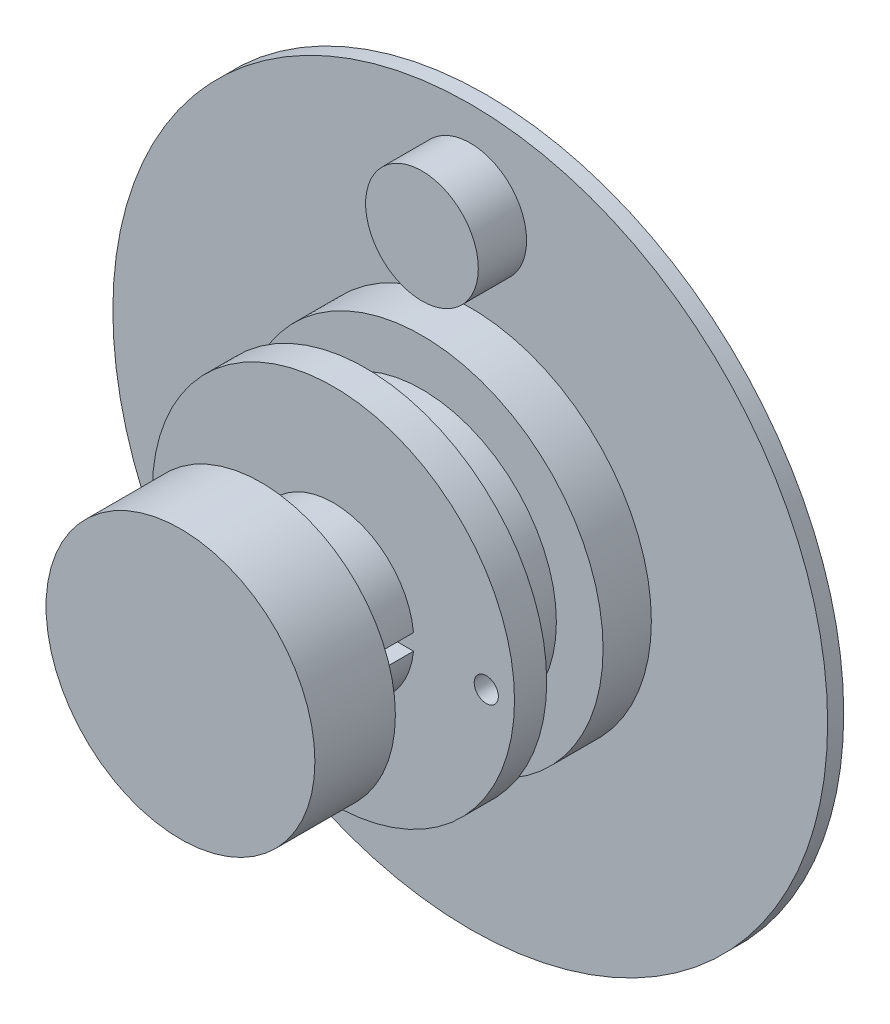
ISO-10303-21;
HEADER;
FILE_DESCRIPTION(('STEP AP214'),'2;1');
FILE_NAME('part.step','',(''),(''),'','','');
FILE_SCHEMA(('AUTOMOTIVE_DESIGN { 1 0 10303 214 1 1 1 1 }'));
ENDSEC;
DATA;
#1=APPLICATION_CONTEXT('core data for automotive mechanical design processes');
#2=APPLICATION_PROTOCOL_DEFINITION('international standard','automotive_design',2000,#1);
#3=PRODUCT_CONTEXT('',#1,'mechanical');
#4=PRODUCT('Part','Part','',(#3));
#5=PRODUCT_RELATED_PRODUCT_CATEGORY('part','',(#4));
#6=PRODUCT_DEFINITION_FORMATION('','',#4);
#7=PRODUCT_DEFINITION_CONTEXT('part definition',#1,'design');
#8=PRODUCT_DEFINITION('design','',#6,#7);
#9=PRODUCT_DEFINITION_SHAPE('','',#8);
#10=(LENGTH_UNIT() NAMED_UNIT(*) SI_UNIT(.MILLI.,.METRE.));
#11=(NAMED_UNIT(*) PLANE_ANGLE_UNIT() SI_UNIT($,.RADIAN.));
#12=(NAMED_UNIT(*) SI_UNIT($,.STERADIAN.) SOLID_ANGLE_UNIT());
#13=UNCERTAINTY_MEASURE_WITH_UNIT(LENGTH_MEASURE(1.E-05),#10,'distance_accuracy_value','');
#14=(GEOMETRIC_REPRESENTATION_CONTEXT(3) GLOBAL_UNCERTAINTY_ASSIGNED_CONTEXT((#13)) GLOBAL_UNIT_ASSIGNED_CONTEXT((#10,
#11,#12)) REPRESENTATION_CONTEXT('',''));
#15=CARTESIAN_POINT('',(0.,0.,0.));
#16=DIRECTION('',(0.,0.,1.));
#17=DIRECTION('',(1.,0.,0.));
#18=AXIS2_PLACEMENT_3D('',#15,#16,#17);
#19=CARTESIAN_POINT('',(0.,0.,9.5));
#20=DIRECTION('',(0.,0.,-1.));
#21=DIRECTION('',(-1.,0.,0.));
#22=AXIS2_PLACEMENT_3D('',#19,#20,#21);
#23=CYLINDRICAL_SURFACE('',#22,11.25);
#24=CARTESIAN_POINT('',(0.,0.,1.));
#25=DIRECTION('',(0.,0.,1.));
#26=DIRECTION('',(1.,0.,0.));
#27=AXIS2_PLACEMENT_3D('',#24,#25,#26);
#28=CIRCLE('',#27,11.25);
#29=CARTESIAN_POINT('',(11.25,0.,1.));
#30=VERTEX_POINT('',#29);
#31=EDGE_CURVE('E110',#30,#30,#28,.T.);
#32=ORIENTED_EDGE('',*,*,#31,.T.);
#33=EDGE_LOOP('',(#32));
#34=FACE_BOUND('',#33,.T.);
#35=CARTESIAN_POINT('',(0.,0.,4.));
#36=DIRECTION('',(0.,0.,1.));
#37=DIRECTION('',(1.,0.,0.));
#38=AXIS2_PLACEMENT_3D('',#35,#36,#37);
#39=CIRCLE('',#38,11.25);
#40=CARTESIAN_POINT('',(11.25,0.,4.));
#41=VERTEX_POINT('',#40);
#42=EDGE_CURVE('E163',#41,#41,#39,.T.);
#43=ORIENTED_EDGE('',*,*,#42,.F.);
#44=EDGE_LOOP('',(#43));
#45=FACE_BOUND('',#44,.T.);
#46=ADVANCED_FACE('F39',(#34,#45),#23,.T.);
#47=CARTESIAN_POINT('',(0.,0.,1.));
#48=DIRECTION('',(0.,0.,-1.));
#49=DIRECTION('',(-1.,0.,0.));
#50=AXIS2_PLACEMENT_3D('',#47,#48,#49);
#51=CYLINDRICAL_SURFACE('',#50,22.2);
#52=CARTESIAN_POINT('',(0.,0.,1.));
#53=DIRECTION('',(0.,0.,1.));
#54=DIRECTION('',(1.,0.,0.));
#55=AXIS2_PLACEMENT_3D('',#52,#53,#54);
#56=CIRCLE('',#55,22.2);
#57=CARTESIAN_POINT('',(22.2,0.,1.));
#58=VERTEX_POINT('',#57);
#59=EDGE_CURVE('E113',#58,#58,#56,.T.);
#60=ORIENTED_EDGE('',*,*,#59,.F.);
#61=EDGE_LOOP('',(#60));
#62=FACE_BOUND('',#61,.T.);
#63=CARTESIAN_POINT('',(0.,0.,0.));
#64=DIRECTION('',(0.,0.,1.));
#65=DIRECTION('',(1.,0.,0.));
#66=AXIS2_PLACEMENT_3D('',#63,#64,#65);
#67=CIRCLE('',#66,22.2);
#68=CARTESIAN_POINT('',(22.2,0.,0.));
#69=VERTEX_POINT('',#68);
#70=EDGE_CURVE('E109',#69,#69,#67,.T.);
#71=ORIENTED_EDGE('',*,*,#70,.T.);
#72=EDGE_LOOP('',(#71));
#73=FACE_BOUND('',#72,.T.);
#74=ADVANCED_FACE('F41',(#62,#73),#51,.T.);
#75=CARTESIAN_POINT('',(0.,0.,1.));
#76=DIRECTION('',(0.,0.,1.));
#77=DIRECTION('',(1.,0.,0.));
#78=AXIS2_PLACEMENT_3D('',#75,#76,#77);
#79=PLANE('',#78);
#80=CARTESIAN_POINT('',(0.,16.6,1.));
#81=DIRECTION('',(0.,0.,1.));
#82=DIRECTION('',(1.,0.,0.));
#83=AXIS2_PLACEMENT_3D('',#80,#81,#82);
#84=CIRCLE('',#83,3.5);
#85=CARTESIAN_POINT('',(3.5,16.6,1.));
#86=VERTEX_POINT('',#85);
#87=EDGE_CURVE('E184',#86,#86,#84,.T.);
#88=ORIENTED_EDGE('',*,*,#87,.F.);
#89=EDGE_LOOP('',(#88));
#90=FACE_BOUND('',#89,.T.);
#91=ORIENTED_EDGE('',*,*,#31,.F.);
#92=EDGE_LOOP('',(#91));
#93=FACE_BOUND('',#92,.T.);
#94=ORIENTED_EDGE('',*,*,#59,.T.);
#95=EDGE_LOOP('',(#94));
#96=FACE_BOUND('',#95,.T.);
#97=ADVANCED_FACE('F122',(#90,#93,#96),#79,.T.);
#98=CARTESIAN_POINT('',(0.,0.,0.));
#99=DIRECTION('',(0.,0.,1.));
#100=DIRECTION('',(1.,0.,0.));
#101=AXIS2_PLACEMENT_3D('',#98,#99,#100);
#102=PLANE('',#101);
#103=CARTESIAN_POINT('',(0.,0.,0.));
#104=DIRECTION('',(0.,0.,-1.));
#105=DIRECTION('',(-1.,0.,0.));
#106=AXIS2_PLACEMENT_3D('',#103,#104,#105);
#107=CIRCLE('',#106,6.);
#108=CARTESIAN_POINT('',(-6.,0.,0.));
#109=VERTEX_POINT('',#108);
#110=EDGE_CURVE('E180',#109,#109,#107,.T.);
#111=ORIENTED_EDGE('',*,*,#110,.F.);
#112=EDGE_LOOP('',(#111));
#113=FACE_BOUND('',#112,.T.);
#114=ORIENTED_EDGE('',*,*,#70,.F.);
#115=EDGE_LOOP('',(#114));
#116=FACE_BOUND('',#115,.T.);
#117=ADVANCED_FACE('F119',(#113,#116),#102,.F.);
#118=CARTESIAN_POINT('',(0.,16.6,4.));
#119=DIRECTION('',(0.,0.,-1.));
#120=DIRECTION('',(-1.,0.,0.));
#121=AXIS2_PLACEMENT_3D('',#118,#119,#120);
#122=CYLINDRICAL_SURFACE('',#121,3.5);
#123=CARTESIAN_POINT('',(0.,16.6,4.));
#124=DIRECTION('',(0.,0.,1.));
#125=DIRECTION('',(1.,0.,0.));
#126=AXIS2_PLACEMENT_3D('',#123,#124,#125);
#127=CIRCLE('',#126,3.5);
#128=CARTESIAN_POINT('',(3.5,16.6,4.));
#129=VERTEX_POINT('',#128);
#130=EDGE_CURVE('E187',#129,#129,#127,.T.);
#131=ORIENTED_EDGE('',*,*,#130,.F.);
#132=EDGE_LOOP('',(#131));
#133=FACE_BOUND('',#132,.T.);
#134=ORIENTED_EDGE('',*,*,#87,.T.);
#135=EDGE_LOOP('',(#134));
#136=FACE_BOUND('',#135,.T.);
#137=ADVANCED_FACE('F121',(#133,#136),#122,.T.);
#138=CARTESIAN_POINT('',(0.,16.6,4.));
#139=DIRECTION('',(0.,0.,1.));
#140=DIRECTION('',(1.,0.,0.));
#141=AXIS2_PLACEMENT_3D('',#138,#139,#140);
#142=PLANE('',#141);
#143=ORIENTED_EDGE('',*,*,#130,.T.);
#144=EDGE_LOOP('',(#143));
#145=FACE_BOUND('',#144,.T.);
#146=ADVANCED_FACE('F128',(#145),#142,.T.);
#147=CARTESIAN_POINT('',(0.,0.,3.5));
#148=DIRECTION('',(0.,0.,-1.));
#149=DIRECTION('',(-1.,0.,0.));
#150=AXIS2_PLACEMENT_3D('',#147,#148,#149);
#151=CYLINDRICAL_SURFACE('',#150,6.);
#152=CARTESIAN_POINT('',(0.,0.,3.5));
#153=DIRECTION('',(0.,0.,-1.));
#154=DIRECTION('',(-1.,0.,0.));
#155=AXIS2_PLACEMENT_3D('',#152,#153,#154);
#156=CIRCLE('',#155,6.);
#157=CARTESIAN_POINT('',(-6.,0.,3.5));
#158=VERTEX_POINT('',#157);
#159=EDGE_CURVE('E181',#158,#158,#156,.T.);
#160=ORIENTED_EDGE('',*,*,#159,.F.);
#161=EDGE_LOOP('',(#160));
#162=FACE_BOUND('',#161,.T.);
#163=ORIENTED_EDGE('',*,*,#110,.T.);
#164=EDGE_LOOP('',(#163));
#165=FACE_BOUND('',#164,.T.);
#166=ADVANCED_FACE('F222',(#162,#165),#151,.F.);
#167=CARTESIAN_POINT('',(0.,0.,3.5));
#168=DIRECTION('',(0.,0.,-1.));
#169=DIRECTION('',(-1.,0.,0.));
#170=AXIS2_PLACEMENT_3D('',#167,#168,#169);
#171=PLANE('',#170);
#172=ORIENTED_EDGE('',*,*,#159,.T.);
#173=EDGE_LOOP('',(#172));
#174=FACE_BOUND('',#173,.T.);
#175=ADVANCED_FACE('F218',(#174),#171,.T.);
#176=CARTESIAN_POINT('',(0.,0.,4.));
#177=DIRECTION('',(0.,0.,1.));
#178=DIRECTION('',(1.,0.,0.));
#179=AXIS2_PLACEMENT_3D('',#176,#177,#178);
#180=PLANE('',#179);
#181=CARTESIAN_POINT('',(0.,0.,4.));
#182=DIRECTION('',(0.,0.,1.));
#183=DIRECTION('',(1.,0.,0.));
#184=AXIS2_PLACEMENT_3D('',#181,#182,#183);
#185=CIRCLE('',#184,8.35);
#186=CARTESIAN_POINT('',(8.35,0.,4.));
#187=VERTEX_POINT('',#186);
#188=EDGE_CURVE('E164',#187,#187,#185,.T.);
#189=ORIENTED_EDGE('',*,*,#188,.F.);
#190=EDGE_LOOP('',(#189));
#191=FACE_BOUND('',#190,.T.);
#192=ORIENTED_EDGE('',*,*,#42,.T.);
#193=EDGE_LOOP('',(#192));
#194=FACE_BOUND('',#193,.T.);
#195=ADVANCED_FACE('F221',(#191,#194),#180,.T.);
#196=CARTESIAN_POINT('',(0.,0.,7.5));
#197=DIRECTION('',(0.,0.,1.));
#198=DIRECTION('',(1.,0.,0.));
#199=AXIS2_PLACEMENT_3D('',#196,#197,#198);
#200=PLANE('',#199);
#201=CARTESIAN_POINT('',(9.49511276106169,-0.304686157748402,7.5));
#202=DIRECTION('',(0.,0.,1.));
#203=DIRECTION('',(1.,0.,0.));
#204=AXIS2_PLACEMENT_3D('',#201,#202,#203);
#205=CIRCLE('',#204,0.75);
#206=CARTESIAN_POINT('',(10.2451127610617,-0.304686157748402,7.5));
#207=VERTEX_POINT('',#206);
#208=EDGE_CURVE('E376',#207,#207,#205,.T.);
#209=ORIENTED_EDGE('',*,*,#208,.T.);
#210=EDGE_LOOP('',(#209));
#211=FACE_BOUND('',#210,.T.);
#212=CARTESIAN_POINT('',(0.,0.,7.5));
#213=DIRECTION('',(0.,0.,1.));
#214=DIRECTION('',(1.,0.,0.));
#215=AXIS2_PLACEMENT_3D('',#212,#213,#214);
#216=CIRCLE('',#215,8.35);
#217=CARTESIAN_POINT('',(8.35,0.,7.5));
#218=VERTEX_POINT('',#217);
#219=EDGE_CURVE('E170',#218,#218,#216,.T.);
#220=ORIENTED_EDGE('',*,*,#219,.T.);
#221=EDGE_LOOP('',(#220));
#222=FACE_BOUND('',#221,.T.);
#223=CARTESIAN_POINT('',(0.,0.,7.5));
#224=DIRECTION('',(0.,0.,1.));
#225=DIRECTION('',(1.,0.,0.));
#226=AXIS2_PLACEMENT_3D('',#223,#224,#225);
#227=CIRCLE('',#226,11.25);
#228=CARTESIAN_POINT('',(11.25,0.,7.5));
#229=VERTEX_POINT('',#228);
#230=EDGE_CURVE('E159',#229,#229,#227,.T.);
#231=ORIENTED_EDGE('',*,*,#230,.F.);
#232=EDGE_LOOP('',(#231));
#233=FACE_BOUND('',#232,.T.);
#234=ADVANCED_FACE('F215',(#211,#222,#233),#200,.F.);
#235=CARTESIAN_POINT('',(0.,0.,4.));
#236=DIRECTION('',(0.,0.,1.));
#237=DIRECTION('',(1.,0.,0.));
#238=AXIS2_PLACEMENT_3D('',#235,#236,#237);
#239=CYLINDRICAL_SURFACE('',#238,8.35);
#240=ORIENTED_EDGE('',*,*,#188,.T.);
#241=EDGE_LOOP('',(#240));
#242=FACE_BOUND('',#241,.T.);
#243=ORIENTED_EDGE('',*,*,#219,.F.);
#244=EDGE_LOOP('',(#243));
#245=FACE_BOUND('',#244,.T.);
#246=ADVANCED_FACE('F235',(#242,#245),#239,.T.);
#247=CARTESIAN_POINT('',(0.,0.,19.));
#248=DIRECTION('',(0.,0.,1.));
#249=DIRECTION('',(1.,0.,0.));
#250=AXIS2_PLACEMENT_3D('',#247,#248,#249);
#251=PLANE('',#250);
#252=CARTESIAN_POINT('',(0.,0.,19.));
#253=DIRECTION('',(0.,0.,1.));
#254=DIRECTION('',(1.,0.,0.));
#255=AXIS2_PLACEMENT_3D('',#252,#253,#254);
#256=CIRCLE('',#255,8.35);
#257=CARTESIAN_POINT('',(8.35,0.,19.));
#258=VERTEX_POINT('',#257);
#259=EDGE_CURVE('E167',#258,#258,#256,.T.);
#260=ORIENTED_EDGE('',*,*,#259,.T.);
#261=EDGE_LOOP('',(#260));
#262=FACE_BOUND('',#261,.T.);
#263=ADVANCED_FACE('F210',(#262),#251,.T.);
#264=CARTESIAN_POINT('',(0.,0.,14.));
#265=DIRECTION('',(0.,0.,1.));
#266=DIRECTION('',(1.,0.,0.));
#267=AXIS2_PLACEMENT_3D('',#264,#265,#266);
#268=CYLINDRICAL_SURFACE('',#267,8.35);
#269=CARTESIAN_POINT('',(0.,0.,14.));
#270=DIRECTION('',(0.,0.,1.));
#271=DIRECTION('',(1.,0.,0.));
#272=AXIS2_PLACEMENT_3D('',#269,#270,#271);
#273=CIRCLE('',#272,8.35);
#274=CARTESIAN_POINT('',(8.35,0.,14.));
#275=VERTEX_POINT('',#274);
#276=EDGE_CURVE('E88',#275,#275,#273,.T.);
#277=ORIENTED_EDGE('',*,*,#276,.T.);
#278=EDGE_LOOP('',(#277));
#279=FACE_BOUND('',#278,.T.);
#280=ORIENTED_EDGE('',*,*,#259,.F.);
#281=EDGE_LOOP('',(#280));
#282=FACE_BOUND('',#281,.T.);
#283=ADVANCED_FACE('F202',(#279,#282),#268,.T.);
#284=CARTESIAN_POINT('',(0.,0.,14.));
#285=DIRECTION('',(0.,0.,1.));
#286=DIRECTION('',(1.,0.,0.));
#287=AXIS2_PLACEMENT_3D('',#284,#285,#286);
#288=PLANE('',#287);
#289=ORIENTED_EDGE('',*,*,#276,.F.);
#290=EDGE_LOOP('',(#289));
#291=FACE_BOUND('',#290,.T.);
#292=DIRECTION('',(-1.,0.,0.));
#293=VECTOR('',#292,1.);
#294=CARTESIAN_POINT('',(0.,0.5,14.));
#295=LINE('',#294,#293);
#296=CARTESIAN_POINT('',(4.9749371855331,0.5,14.));
#297=VERTEX_POINT('',#296);
#298=CARTESIAN_POINT('',(-4.9749371855331,0.5,14.));
#299=VERTEX_POINT('',#298);
#300=EDGE_CURVE('E11',#297,#299,#295,.T.);
#301=ORIENTED_EDGE('',*,*,#300,.F.);
#302=CARTESIAN_POINT('',(0.,0.,14.));
#303=DIRECTION('',(0.,0.,1.));
#304=DIRECTION('',(1.,0.,0.));
#305=AXIS2_PLACEMENT_3D('',#302,#303,#304);
#306=CIRCLE('',#305,5.);
#307=EDGE_CURVE('E60',#297,#299,#306,.T.);
#308=ORIENTED_EDGE('',*,*,#307,.T.);
#309=EDGE_LOOP('',(#301,#308));
#310=FACE_BOUND('',#309,.T.);
#311=DIRECTION('',(1.,0.,0.));
#312=VECTOR('',#311,1.);
#313=CARTESIAN_POINT('',(0.,-0.5,14.));
#314=LINE('',#313,#312);
#315=CARTESIAN_POINT('',(-4.9749371855331,-0.5,14.));
#316=VERTEX_POINT('',#315);
#317=CARTESIAN_POINT('',(4.9749371855331,-0.5,14.));
#318=VERTEX_POINT('',#317);
#319=EDGE_CURVE('E87',#316,#318,#314,.T.);
#320=ORIENTED_EDGE('',*,*,#319,.F.);
#321=CARTESIAN_POINT('',(0.,0.,14.));
#322=DIRECTION('',(0.,0.,1.));
#323=DIRECTION('',(1.,0.,0.));
#324=AXIS2_PLACEMENT_3D('',#321,#322,#323);
#325=CIRCLE('',#324,5.);
#326=EDGE_CURVE('E53',#316,#318,#325,.T.);
#327=ORIENTED_EDGE('',*,*,#326,.T.);
#328=EDGE_LOOP('',(#320,#327));
#329=FACE_BOUND('',#328,.T.);
#330=ADVANCED_FACE('F76',(#291,#310,#329),#288,.F.);
#331=CARTESIAN_POINT('',(0.,0.,19.));
#332=DIRECTION('',(0.,0.,-1.));
#333=DIRECTION('',(-1.,0.,0.));
#334=AXIS2_PLACEMENT_3D('',#331,#332,#333);
#335=CYLINDRICAL_SURFACE('',#334,5.);
#336=ORIENTED_EDGE('',*,*,#307,.F.);
#337=DIRECTION('',(0.,0.,-1.));
#338=VECTOR('',#337,1.);
#339=CARTESIAN_POINT('',(4.9749371855331,0.5,19.));
#340=LINE('',#339,#338);
#341=CARTESIAN_POINT('',(4.9749371855331,0.5,9.5));
#342=VERTEX_POINT('',#341);
#343=EDGE_CURVE('E84',#342,#297,#340,.F.);
#344=ORIENTED_EDGE('',*,*,#343,.F.);
#345=CARTESIAN_POINT('',(0.,0.,9.5));
#346=DIRECTION('',(0.,0.,1.));
#347=DIRECTION('',(1.,0.,0.));
#348=AXIS2_PLACEMENT_3D('',#345,#346,#347);
#349=CIRCLE('',#348,5.);
#350=CARTESIAN_POINT('',(-4.9749371855331,0.5,9.5));
#351=VERTEX_POINT('',#350);
#352=EDGE_CURVE('E47',#342,#351,#349,.T.);
#353=ORIENTED_EDGE('',*,*,#352,.T.);
#354=DIRECTION('',(0.,0.,-1.));
#355=VECTOR('',#354,1.);
#356=CARTESIAN_POINT('',(-4.9749371855331,0.5,19.));
#357=LINE('',#356,#355);
#358=EDGE_CURVE('E86',#299,#351,#357,.T.);
#359=ORIENTED_EDGE('',*,*,#358,.F.);
#360=EDGE_LOOP('',(#336,#344,#353,#359));
#361=FACE_BOUND('',#360,.T.);
#362=ADVANCED_FACE('F82',(#361),#335,.T.);
#363=CARTESIAN_POINT('',(0.,0.5,-2.16468915282985));
#364=DIRECTION('',(0.,-1.,0.));
#365=DIRECTION('',(0.,0.,-1.));
#366=AXIS2_PLACEMENT_3D('',#363,#364,#365);
#367=PLANE('',#366);
#368=ORIENTED_EDGE('',*,*,#343,.T.);
#369=ORIENTED_EDGE('',*,*,#300,.T.);
#370=ORIENTED_EDGE('',*,*,#358,.T.);
#371=DIRECTION('',(-1.,0.,0.));
#372=VECTOR('',#371,1.);
#373=CARTESIAN_POINT('',(0.,0.5,9.5));
#374=LINE('',#373,#372);
#375=EDGE_CURVE('E92',#342,#351,#374,.T.);
#376=ORIENTED_EDGE('',*,*,#375,.F.);
#377=EDGE_LOOP('',(#368,#369,#370,#376));
#378=FACE_BOUND('',#377,.T.);
#379=ADVANCED_FACE('F90',(#378),#367,.T.);
#380=ORIENTED_EDGE('',*,*,#326,.F.);
#381=DIRECTION('',(0.,0.,-1.));
#382=VECTOR('',#381,1.);
#383=CARTESIAN_POINT('',(-4.9749371855331,-0.5,19.));
#384=LINE('',#383,#382);
#385=CARTESIAN_POINT('',(-4.9749371855331,-0.5,9.5));
#386=VERTEX_POINT('',#385);
#387=EDGE_CURVE('E94',#386,#316,#384,.F.);
#388=ORIENTED_EDGE('',*,*,#387,.F.);
#389=CARTESIAN_POINT('',(4.9749371855331,-0.5,9.5));
#390=VERTEX_POINT('',#389);
#391=EDGE_CURVE('E106',#386,#390,#349,.T.);
#392=ORIENTED_EDGE('',*,*,#391,.T.);
#393=DIRECTION('',(0.,0.,-1.));
#394=VECTOR('',#393,1.);
#395=CARTESIAN_POINT('',(4.9749371855331,-0.5,19.));
#396=LINE('',#395,#394);
#397=EDGE_CURVE('E102',#318,#390,#396,.T.);
#398=ORIENTED_EDGE('',*,*,#397,.F.);
#399=EDGE_LOOP('',(#380,#388,#392,#398));
#400=FACE_BOUND('',#399,.T.);
#401=ADVANCED_FACE('F200',(#400),#335,.T.);
#402=CARTESIAN_POINT('',(0.,-0.5,-2.16468915282985));
#403=DIRECTION('',(0.,1.,0.));
#404=DIRECTION('',(0.,0.,1.));
#405=AXIS2_PLACEMENT_3D('',#402,#403,#404);
#406=PLANE('',#405);
#407=ORIENTED_EDGE('',*,*,#387,.T.);
#408=ORIENTED_EDGE('',*,*,#319,.T.);
#409=ORIENTED_EDGE('',*,*,#397,.T.);
#410=DIRECTION('',(1.,0.,0.));
#411=VECTOR('',#410,1.);
#412=CARTESIAN_POINT('',(0.,-0.5,9.5));
#413=LINE('',#412,#411);
#414=EDGE_CURVE('E96',#386,#390,#413,.T.);
#415=ORIENTED_EDGE('',*,*,#414,.F.);
#416=EDGE_LOOP('',(#407,#408,#409,#415));
#417=FACE_BOUND('',#416,.T.);
#418=ADVANCED_FACE('F154',(#417),#406,.T.);
#419=CARTESIAN_POINT('',(0.,0.,9.5));
#420=DIRECTION('',(0.,0.,1.));
#421=DIRECTION('',(1.,0.,0.));
#422=AXIS2_PLACEMENT_3D('',#419,#420,#421);
#423=PLANE('',#422);
#424=CARTESIAN_POINT('',(9.49511276106169,-0.304686157748402,9.5));
#425=DIRECTION('',(0.,0.,1.));
#426=DIRECTION('',(1.,0.,0.));
#427=AXIS2_PLACEMENT_3D('',#424,#425,#426);
#428=CIRCLE('',#427,0.75);
#429=CARTESIAN_POINT('',(10.2451127610617,-0.304686157748402,9.5));
#430=VERTEX_POINT('',#429);
#431=EDGE_CURVE('E378',#430,#430,#428,.T.);
#432=ORIENTED_EDGE('',*,*,#431,.F.);
#433=EDGE_LOOP('',(#432));
#434=FACE_BOUND('',#433,.T.);
#435=ORIENTED_EDGE('',*,*,#414,.T.);
#436=ORIENTED_EDGE('',*,*,#391,.F.);
#437=EDGE_LOOP('',(#435,#436));
#438=FACE_BOUND('',#437,.T.);
#439=ORIENTED_EDGE('',*,*,#375,.T.);
#440=ORIENTED_EDGE('',*,*,#352,.F.);
#441=EDGE_LOOP('',(#439,#440));
#442=FACE_BOUND('',#441,.T.);
#443=CARTESIAN_POINT('',(0.,0.,9.5));
#444=DIRECTION('',(0.,0.,1.));
#445=DIRECTION('',(1.,0.,0.));
#446=AXIS2_PLACEMENT_3D('',#443,#444,#445);
#447=CIRCLE('',#446,11.25);
#448=CARTESIAN_POINT('',(11.25,0.,9.5));
#449=VERTEX_POINT('',#448);
#450=EDGE_CURVE('E104',#449,#449,#447,.T.);
#451=ORIENTED_EDGE('',*,*,#450,.T.);
#452=EDGE_LOOP('',(#451));
#453=FACE_BOUND('',#452,.T.);
#454=ADVANCED_FACE('F146',(#434,#438,#442,#453),#423,.T.);
#455=ORIENTED_EDGE('',*,*,#230,.T.);
#456=EDGE_LOOP('',(#455));
#457=FACE_BOUND('',#456,.T.);
#458=ORIENTED_EDGE('',*,*,#450,.F.);
#459=EDGE_LOOP('',(#458));
#460=FACE_BOUND('',#459,.T.);
#461=ADVANCED_FACE('F137',(#457,#460),#23,.T.);
#462=CARTESIAN_POINT('',(9.49511276106169,-0.304686157748402,6.50000000000001));
#463=DIRECTION('',(0.,0.,1.));
#464=DIRECTION('',(1.,0.,0.));
#465=AXIS2_PLACEMENT_3D('',#462,#463,#464);
#466=CYLINDRICAL_SURFACE('',#465,0.75);
#467=ORIENTED_EDGE('',*,*,#431,.T.);
#468=EDGE_LOOP('',(#467));
#469=FACE_BOUND('',#468,.T.);
#470=ORIENTED_EDGE('',*,*,#208,.F.);
#471=EDGE_LOOP('',(#470));
#472=FACE_BOUND('',#471,.T.);
#473=ADVANCED_FACE('F145',(#469,#472),#466,.F.);
#474=CLOSED_SHELL('',(#46,#74,#97,#117,#137,#146,#166,#175,#195,#234,#246,#263,#283,#330,#362,
#379,#401,#418,#454,#461,#473));
#475=MANIFOLD_SOLID_BREP('B2',#474);
#476=ADVANCED_BREP_SHAPE_REPRESENTATION('',(#18,#475),#14);
#477=SHAPE_DEFINITION_REPRESENTATION(#9,#476);
ENDSEC;
END-ISO-10303-21;
